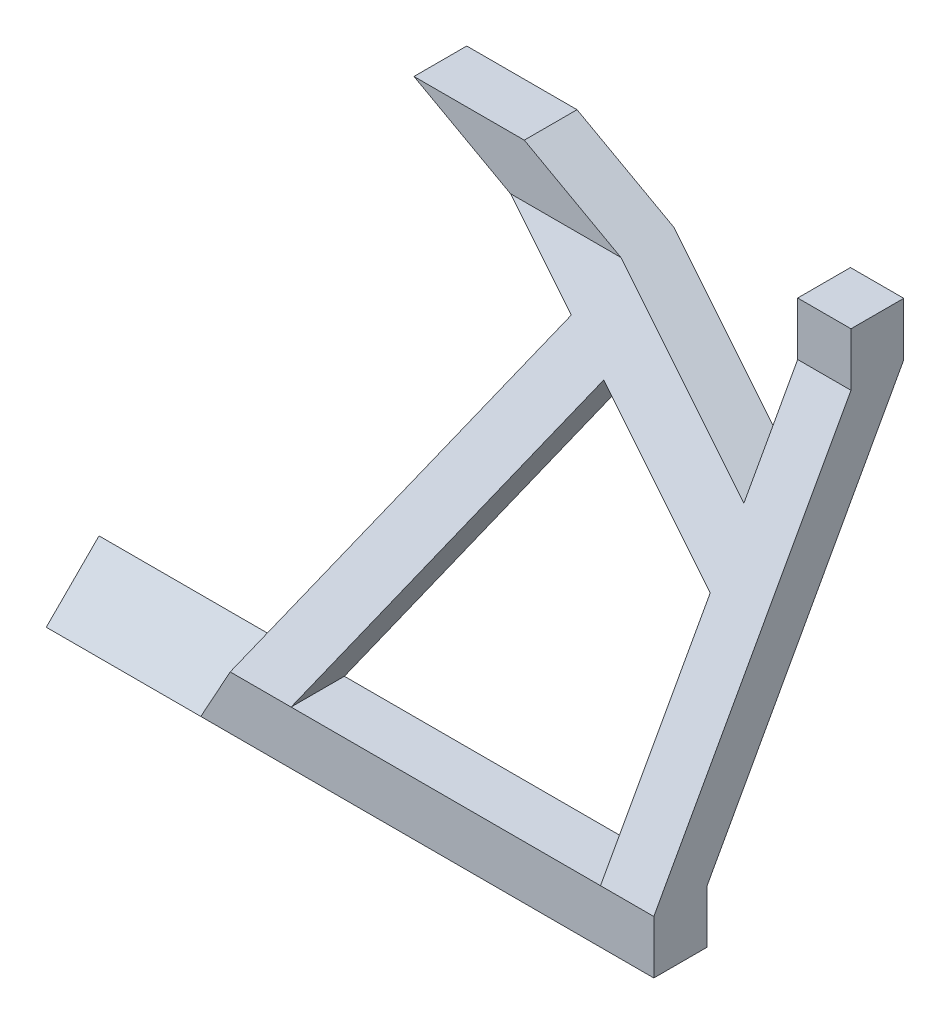
ISO-10303-21;
HEADER;
FILE_DESCRIPTION(('STEP AP214'),'2;1');
FILE_NAME('part.step','',(''),(''),'','','');
FILE_SCHEMA(('AUTOMOTIVE_DESIGN { 1 0 10303 214 1 1 1 1 }'));
ENDSEC;
DATA;
#1=APPLICATION_CONTEXT('core data for automotive mechanical design processes');
#2=APPLICATION_PROTOCOL_DEFINITION('international standard','automotive_design',2000,#1);
#3=PRODUCT_CONTEXT('',#1,'mechanical');
#4=PRODUCT('Part','Part','',(#3));
#5=PRODUCT_RELATED_PRODUCT_CATEGORY('part','',(#4));
#6=PRODUCT_DEFINITION_FORMATION('','',#4);
#7=PRODUCT_DEFINITION_CONTEXT('part definition',#1,'design');
#8=PRODUCT_DEFINITION('design','',#6,#7);
#9=PRODUCT_DEFINITION_SHAPE('','',#8);
#10=(LENGTH_UNIT() NAMED_UNIT(*) SI_UNIT(.MILLI.,.METRE.));
#11=(NAMED_UNIT(*) PLANE_ANGLE_UNIT() SI_UNIT($,.RADIAN.));
#12=(NAMED_UNIT(*) SI_UNIT($,.STERADIAN.) SOLID_ANGLE_UNIT());
#13=UNCERTAINTY_MEASURE_WITH_UNIT(LENGTH_MEASURE(1.E-05),#10,'distance_accuracy_value','');
#14=(GEOMETRIC_REPRESENTATION_CONTEXT(3) GLOBAL_UNCERTAINTY_ASSIGNED_CONTEXT((#13)) GLOBAL_UNIT_ASSIGNED_CONTEXT((#10,
#11,#12)) REPRESENTATION_CONTEXT('',''));
#15=CARTESIAN_POINT('',(0.,0.,0.));
#16=DIRECTION('',(0.,0.,1.));
#17=DIRECTION('',(1.,0.,0.));
#18=AXIS2_PLACEMENT_3D('',#15,#16,#17);
#19=CARTESIAN_POINT('',(0.,29.5620174648456,53.6762918738388));
#20=DIRECTION('',(0.,-0.482420541255381,-0.875939736154757));
#21=DIRECTION('',(0.,0.875939736154757,-0.482420541255381));
#22=AXIS2_PLACEMENT_3D('',#19,#20,#21);
#23=PLANE('',#22);
#24=DIRECTION('',(0.435173799181996,0.788649248632509,-0.434345630963277));
#25=VECTOR('',#24,1.);
#26=CARTESIAN_POINT('',(61.1524327788924,3.67148150275816,67.935407948481));
#27=LINE('',#26,#25);
#28=CARTESIAN_POINT('',(64.6444863659764,10.,64.45));
#29=VERTEX_POINT('',#28);
#30=CARTESIAN_POINT('',(93.9619940574629,63.1310259398199,35.188285713741));
#31=VERTEX_POINT('',#30);
#32=EDGE_CURVE('E428',#29,#31,#27,.T.);
#33=ORIENTED_EDGE('',*,*,#32,.F.);
#34=DIRECTION('',(1.,0.,0.));
#35=VECTOR('',#34,1.);
#36=CARTESIAN_POINT('',(0.,10.,64.45));
#37=LINE('',#36,#35);
#38=CARTESIAN_POINT('',(53.2231062253911,10.,64.45));
#39=VERTEX_POINT('',#38);
#40=EDGE_CURVE('E775',#29,#39,#37,.F.);
#41=ORIENTED_EDGE('',*,*,#40,.T.);
#42=DIRECTION('',(-0.435173799181996,-0.788649248632509,0.434345630963277));
#43=VECTOR('',#42,1.);
#44=CARTESIAN_POINT('',(51.8939906134827,7.59129333924137,65.7765862057014));
#45=LINE('',#44,#43);
#46=CARTESIAN_POINT('',(85.2064847609414,67.9622842602294,32.5274882208588));
#47=VERTEX_POINT('',#46);
#48=EDGE_CURVE('E417',#47,#39,#45,.T.);
#49=ORIENTED_EDGE('',*,*,#48,.F.);
#50=DIRECTION('',(0.846111406818246,-0.466881209960925,0.257133084291912));
#51=VECTOR('',#50,1.);
#52=CARTESIAN_POINT('',(43.9773724193007,90.7123591328342,19.9979693731107));
#53=LINE('',#52,#51);
#54=CARTESIAN_POINT('',(68.8277695420515,77.,27.55));
#55=VERTEX_POINT('',#54);
#56=EDGE_CURVE('E401',#55,#47,#53,.T.);
#57=ORIENTED_EDGE('',*,*,#56,.F.);
#58=DIRECTION('',(-1.,0.,0.));
#59=VECTOR('',#58,1.);
#60=CARTESIAN_POINT('',(50.7051424419148,77.,27.55));
#61=LINE('',#60,#59);
#62=CARTESIAN_POINT('',(89.5263108677249,77.,27.55));
#63=VERTEX_POINT('',#62);
#64=EDGE_CURVE('E757',#63,#55,#61,.T.);
#65=ORIENTED_EDGE('',*,*,#64,.F.);
#66=DIRECTION('',(0.846111406818246,-0.466881209960924,0.257133084291912));
#67=VECTOR('',#66,1.);
#68=CARTESIAN_POINT('',(49.8577346026244,98.8889767172891,15.4947277482393));
#69=LINE('',#68,#67);
#70=CARTESIAN_POINT('',(122.705142441915,58.6920408995561,37.6330401612893));
#71=VERTEX_POINT('',#70);
#72=EDGE_CURVE('E382',#63,#71,#69,.T.);
#73=ORIENTED_EDGE('',*,*,#72,.T.);
#74=DIRECTION('',(0.,0.875939736154757,-0.482420541255381));
#75=VECTOR('',#74,1.);
#76=CARTESIAN_POINT('',(122.705142441915,29.5620174648453,53.6762918738389));
#77=LINE('',#76,#75);
#78=CARTESIAN_POINT('',(122.705142441915,77.,27.55));
#79=VERTEX_POINT('',#78);
#80=EDGE_CURVE('E362',#71,#79,#77,.T.);
#81=ORIENTED_EDGE('',*,*,#80,.T.);
#82=CARTESIAN_POINT('',(132.705142441915,77.,27.55));
#83=VERTEX_POINT('',#82);
#84=EDGE_CURVE('E451',#83,#79,#61,.T.);
#85=ORIENTED_EDGE('',*,*,#84,.F.);
#86=DIRECTION('',(0.,-0.875939736154757,0.482420541255381));
#87=VECTOR('',#86,1.);
#88=CARTESIAN_POINT('',(132.705142441915,77.,27.55));
#89=LINE('',#88,#87);
#90=CARTESIAN_POINT('',(132.705142441915,10.,64.45));
#91=VERTEX_POINT('',#90);
#92=EDGE_CURVE('E457',#83,#91,#89,.T.);
#93=ORIENTED_EDGE('',*,*,#92,.T.);
#94=CARTESIAN_POINT('',(122.705142441915,10.,64.45));
#95=VERTEX_POINT('',#94);
#96=EDGE_CURVE('E773',#91,#95,#37,.F.);
#97=ORIENTED_EDGE('',*,*,#96,.T.);
#98=DIRECTION('',(0.,-0.875939736154757,0.482420541255381));
#99=VECTOR('',#98,1.);
#100=CARTESIAN_POINT('',(122.705142441915,29.562017464846,53.6762918738386));
#101=LINE('',#100,#99);
#102=CARTESIAN_POINT('',(122.705142441915,47.2706607589708,43.9233226566265));
#103=VERTEX_POINT('',#102);
#104=EDGE_CURVE('E424',#103,#95,#101,.T.);
#105=ORIENTED_EDGE('',*,*,#104,.F.);
#106=DIRECTION('',(0.846111406818246,-0.466881209960924,0.257133084291912));
#107=VECTOR('',#106,1.);
#108=CARTESIAN_POINT('',(43.9773724193006,90.7123591328342,19.9979693731107));
#109=LINE('',#108,#107);
#110=EDGE_CURVE('E422',#31,#103,#109,.T.);
#111=ORIENTED_EDGE('',*,*,#110,.F.);
#112=EDGE_LOOP('',(#33,#41,#49,#57,#65,#73,#81,#85,#93,#97,#105,#111));
#113=FACE_BOUND('',#112,.T.);
#114=ADVANCED_FACE('F176',(#113),#23,.T.);
#115=CARTESIAN_POINT('',(0.,33.842872994196,61.2830402867873));
#116=DIRECTION('',(0.,0.483422700834169,0.875387052861874));
#117=DIRECTION('',(0.,-0.875387052861874,0.483422700834169));
#118=AXIS2_PLACEMENT_3D('',#115,#116,#117);
#119=PLANE('',#118);
#120=DIRECTION('',(-0.434951180292689,-0.788245804720872,0.435299922010034));
#121=VECTOR('',#120,1.);
#122=CARTESIAN_POINT('',(63.082326799024,7.16895646972114,76.0134120988107));
#123=LINE('',#122,#121);
#124=CARTESIAN_POINT('',(93.9619940574629,63.1310259398199,45.1089856750248));
#125=VERTEX_POINT('',#124);
#126=CARTESIAN_POINT('',(64.6444863659764,10.,74.45));
#127=VERTEX_POINT('',#126);
#128=EDGE_CURVE('E790',#125,#127,#123,.T.);
#129=ORIENTED_EDGE('',*,*,#128,.F.);
#130=DIRECTION('',(-0.845959635986386,0.466797463365565,-0.257783673798894));
#131=VECTOR('',#130,1.);
#132=CARTESIAN_POINT('',(41.8111105903259,91.9076945646152,29.2173925538692));
#133=LINE('',#132,#131);
#134=CARTESIAN_POINT('',(122.705142441915,47.2706607589708,53.8676948047474));
#135=VERTEX_POINT('',#134);
#136=EDGE_CURVE('E797',#135,#125,#133,.T.);
#137=ORIENTED_EDGE('',*,*,#136,.F.);
#138=DIRECTION('',(0.,0.875387052861874,-0.483422700834169));
#139=VECTOR('',#138,1.);
#140=CARTESIAN_POINT('',(122.705142441915,33.8428729941964,61.283040286787));
#141=LINE('',#140,#139);
#142=CARTESIAN_POINT('',(122.705142441915,9.99999999999999,74.45));
#143=VERTEX_POINT('',#142);
#144=EDGE_CURVE('E791',#143,#135,#141,.T.);
#145=ORIENTED_EDGE('',*,*,#144,.F.);
#146=DIRECTION('',(1.,0.,0.));
#147=VECTOR('',#146,1.);
#148=CARTESIAN_POINT('',(0.,9.99999999999998,74.45));
#149=LINE('',#148,#147);
#150=CARTESIAN_POINT('',(132.705142441915,10.,74.45));
#151=VERTEX_POINT('',#150);
#152=EDGE_CURVE('E768',#143,#151,#149,.T.);
#153=ORIENTED_EDGE('',*,*,#152,.T.);
#154=DIRECTION('',(0.,-0.875387052861874,0.483422700834169));
#155=VECTOR('',#154,1.);
#156=CARTESIAN_POINT('',(132.705142441915,77.,37.45));
#157=LINE('',#156,#155);
#158=CARTESIAN_POINT('',(132.705142441915,77.,37.45));
#159=VERTEX_POINT('',#158);
#160=EDGE_CURVE('E784',#159,#151,#157,.T.);
#161=ORIENTED_EDGE('',*,*,#160,.F.);
#162=DIRECTION('',(1.,0.,0.));
#163=VECTOR('',#162,1.);
#164=CARTESIAN_POINT('',(50.7051424419148,77.,37.45));
#165=LINE('',#164,#163);
#166=CARTESIAN_POINT('',(122.705142441915,77.,37.45));
#167=VERTEX_POINT('',#166);
#168=EDGE_CURVE('E508',#167,#159,#165,.T.);
#169=ORIENTED_EDGE('',*,*,#168,.F.);
#170=DIRECTION('',(0.,-0.875387052861874,0.483422700834169));
#171=VECTOR('',#170,1.);
#172=CARTESIAN_POINT('',(122.705142441915,33.8428729941957,61.2830402867874));
#173=LINE('',#172,#171);
#174=CARTESIAN_POINT('',(122.705142441915,58.6920408995561,47.5603654733795));
#175=VERTEX_POINT('',#174);
#176=EDGE_CURVE('E372',#167,#175,#173,.T.);
#177=ORIENTED_EDGE('',*,*,#176,.T.);
#178=DIRECTION('',(-0.845959635986386,0.466797463365565,-0.257783673798894));
#179=VECTOR('',#178,1.);
#180=CARTESIAN_POINT('',(47.6967883045674,100.081379058361,24.7035667886665));
#181=LINE('',#180,#179);
#182=CARTESIAN_POINT('',(89.5263108677249,77.,37.45));
#183=VERTEX_POINT('',#182);
#184=EDGE_CURVE('E392',#175,#183,#181,.T.);
#185=ORIENTED_EDGE('',*,*,#184,.T.);
#186=CARTESIAN_POINT('',(68.8277695420515,77.,37.45));
#187=VERTEX_POINT('',#186);
#188=EDGE_CURVE('E503',#187,#183,#165,.T.);
#189=ORIENTED_EDGE('',*,*,#188,.F.);
#190=DIRECTION('',(-0.845959635986386,0.466797463365566,-0.257783673798894));
#191=VECTOR('',#190,1.);
#192=CARTESIAN_POINT('',(41.811110590326,91.9076945646152,29.2173925538692));
#193=LINE('',#192,#191);
#194=CARTESIAN_POINT('',(85.2064847609414,67.9622842602294,42.4409773488285));
#195=VERTEX_POINT('',#194);
#196=EDGE_CURVE('E409',#195,#187,#193,.T.);
#197=ORIENTED_EDGE('',*,*,#196,.F.);
#198=DIRECTION('',(0.434951180292689,0.788245804720872,-0.435299922010034));
#199=VECTOR('',#198,1.);
#200=CARTESIAN_POINT('',(53.8216722408234,11.0847588692494,73.8509540572802));
#201=LINE('',#200,#199);
#202=CARTESIAN_POINT('',(53.2231062253911,9.99999999999998,74.45));
#203=VERTEX_POINT('',#202);
#204=EDGE_CURVE('E745',#203,#195,#201,.T.);
#205=ORIENTED_EDGE('',*,*,#204,.F.);
#206=EDGE_CURVE('E772',#203,#127,#149,.T.);
#207=ORIENTED_EDGE('',*,*,#206,.T.);
#208=EDGE_LOOP('',(#129,#137,#145,#153,#161,#169,#177,#185,#189,#197,#205,#207));
#209=FACE_BOUND('',#208,.T.);
#210=ADVANCED_FACE('F469',(#209),#119,.T.);
#211=CARTESIAN_POINT('',(50.7051424419148,77.,37.45));
#212=DIRECTION('',(0.,0.,1.));
#213=DIRECTION('',(1.,0.,0.));
#214=AXIS2_PLACEMENT_3D('',#211,#212,#213);
#215=PLANE('',#214);
#216=DIRECTION('',(-0.875550929652146,0.483125832040953,0.));
#217=VECTOR('',#216,1.);
#218=CARTESIAN_POINT('',(54.9351551557391,84.6658943041474,37.45));
#219=LINE('',#218,#217);
#220=CARTESIAN_POINT('',(50.7051424419148,87.,37.45));
#221=VERTEX_POINT('',#220);
#222=EDGE_CURVE('E405',#187,#221,#219,.T.);
#223=ORIENTED_EDGE('',*,*,#222,.F.);
#224=ORIENTED_EDGE('',*,*,#188,.T.);
#225=DIRECTION('',(-0.875550929652146,0.483125832040952,0.));
#226=VECTOR('',#225,1.);
#227=CARTESIAN_POINT('',(59.7664134761486,93.4214036006688,37.45));
#228=LINE('',#227,#226);
#229=CARTESIAN_POINT('',(71.4036837675881,87.,37.45));
#230=VERTEX_POINT('',#229);
#231=EDGE_CURVE('E387',#183,#230,#228,.T.);
#232=ORIENTED_EDGE('',*,*,#231,.T.);
#233=DIRECTION('',(1.,0.,0.));
#234=VECTOR('',#233,1.);
#235=CARTESIAN_POINT('',(50.7051424419148,87.,37.45));
#236=LINE('',#235,#234);
#237=EDGE_CURVE('E442',#221,#230,#236,.T.);
#238=ORIENTED_EDGE('',*,*,#237,.F.);
#239=EDGE_LOOP('',(#223,#224,#232,#238));
#240=FACE_BOUND('',#239,.T.);
#241=ADVANCED_FACE('F476',(#240),#215,.T.);
#242=CARTESIAN_POINT('',(122.705142441915,87.,37.45));
#243=VERTEX_POINT('',#242);
#244=CARTESIAN_POINT('',(132.705142441915,87.,37.45));
#245=VERTEX_POINT('',#244);
#246=EDGE_CURVE('E441',#243,#245,#236,.T.);
#247=ORIENTED_EDGE('',*,*,#246,.F.);
#248=DIRECTION('',(0.,-1.,0.));
#249=VECTOR('',#248,1.);
#250=CARTESIAN_POINT('',(122.705142441915,76.9999999999998,37.45));
#251=LINE('',#250,#249);
#252=EDGE_CURVE('E367',#243,#167,#251,.T.);
#253=ORIENTED_EDGE('',*,*,#252,.T.);
#254=ORIENTED_EDGE('',*,*,#168,.T.);
#255=DIRECTION('',(0.,1.,0.));
#256=VECTOR('',#255,1.);
#257=CARTESIAN_POINT('',(132.705142441915,77.,37.45));
#258=LINE('',#257,#256);
#259=EDGE_CURVE('E737',#159,#245,#258,.T.);
#260=ORIENTED_EDGE('',*,*,#259,.T.);
#261=EDGE_LOOP('',(#247,#253,#254,#260));
#262=FACE_BOUND('',#261,.T.);
#263=ADVANCED_FACE('F526',(#262),#215,.T.);
#264=CARTESIAN_POINT('',(50.7051424419148,77.,27.55));
#265=DIRECTION('',(0.,0.,-1.));
#266=DIRECTION('',(-1.,0.,0.));
#267=AXIS2_PLACEMENT_3D('',#264,#265,#266);
#268=PLANE('',#267);
#269=DIRECTION('',(0.875550929652146,-0.483125832040953,0.));
#270=VECTOR('',#269,1.);
#271=CARTESIAN_POINT('',(54.9351551557391,84.6658943041474,27.55));
#272=LINE('',#271,#270);
#273=CARTESIAN_POINT('',(50.7051424419148,87.,27.55));
#274=VERTEX_POINT('',#273);
#275=EDGE_CURVE('E397',#274,#55,#272,.T.);
#276=ORIENTED_EDGE('',*,*,#275,.F.);
#277=DIRECTION('',(-1.,0.,0.));
#278=VECTOR('',#277,1.);
#279=CARTESIAN_POINT('',(50.7051424419148,87.,27.55));
#280=LINE('',#279,#278);
#281=CARTESIAN_POINT('',(71.4036837675881,87.,27.55));
#282=VERTEX_POINT('',#281);
#283=EDGE_CURVE('E434',#282,#274,#280,.T.);
#284=ORIENTED_EDGE('',*,*,#283,.F.);
#285=DIRECTION('',(0.875550929652146,-0.483125832040952,0.));
#286=VECTOR('',#285,1.);
#287=CARTESIAN_POINT('',(59.7664134761486,93.4214036006688,27.55));
#288=LINE('',#287,#286);
#289=EDGE_CURVE('E377',#282,#63,#288,.T.);
#290=ORIENTED_EDGE('',*,*,#289,.T.);
#291=ORIENTED_EDGE('',*,*,#64,.T.);
#292=EDGE_LOOP('',(#276,#284,#290,#291));
#293=FACE_BOUND('',#292,.T.);
#294=ADVANCED_FACE('F470',(#293),#268,.T.);
#295=ORIENTED_EDGE('',*,*,#84,.T.);
#296=DIRECTION('',(0.,1.,0.));
#297=VECTOR('',#296,1.);
#298=CARTESIAN_POINT('',(122.705142441915,76.9999999999998,27.55));
#299=LINE('',#298,#297);
#300=CARTESIAN_POINT('',(122.705142441915,87.,27.55));
#301=VERTEX_POINT('',#300);
#302=EDGE_CURVE('E359',#79,#301,#299,.T.);
#303=ORIENTED_EDGE('',*,*,#302,.T.);
#304=CARTESIAN_POINT('',(132.705142441915,87.,27.55));
#305=VERTEX_POINT('',#304);
#306=EDGE_CURVE('E435',#305,#301,#280,.T.);
#307=ORIENTED_EDGE('',*,*,#306,.F.);
#308=DIRECTION('',(0.,1.,0.));
#309=VECTOR('',#308,1.);
#310=CARTESIAN_POINT('',(132.705142441915,77.,27.55));
#311=LINE('',#310,#309);
#312=EDGE_CURVE('E445',#83,#305,#311,.T.);
#313=ORIENTED_EDGE('',*,*,#312,.F.);
#314=EDGE_LOOP('',(#295,#303,#307,#313));
#315=FACE_BOUND('',#314,.T.);
#316=ADVANCED_FACE('F532',(#315),#268,.T.);
#317=CARTESIAN_POINT('',(0.,87.,0.));
#318=DIRECTION('',(0.,-1.,0.));
#319=DIRECTION('',(0.,0.,-1.));
#320=AXIS2_PLACEMENT_3D('',#317,#318,#319);
#321=PLANE('',#320);
#322=DIRECTION('',(0.,0.,1.));
#323=VECTOR('',#322,1.);
#324=CARTESIAN_POINT('',(71.4036837675881,87.,0.));
#325=LINE('',#324,#323);
#326=EDGE_CURVE('E742',#282,#230,#325,.T.);
#327=ORIENTED_EDGE('',*,*,#326,.F.);
#328=ORIENTED_EDGE('',*,*,#283,.T.);
#329=DIRECTION('',(0.,0.,1.));
#330=VECTOR('',#329,1.);
#331=CARTESIAN_POINT('',(50.7051424419148,87.,37.45));
#332=LINE('',#331,#330);
#333=EDGE_CURVE('E438',#274,#221,#332,.T.);
#334=ORIENTED_EDGE('',*,*,#333,.T.);
#335=ORIENTED_EDGE('',*,*,#237,.T.);
#336=EDGE_LOOP('',(#327,#328,#334,#335));
#337=FACE_BOUND('',#336,.T.);
#338=ADVANCED_FACE('F528',(#337),#321,.F.);
#339=DIRECTION('',(0.,0.,-1.));
#340=VECTOR('',#339,1.);
#341=CARTESIAN_POINT('',(122.705142441915,87.,0.));
#342=LINE('',#341,#340);
#343=EDGE_CURVE('E740',#243,#301,#342,.T.);
#344=ORIENTED_EDGE('',*,*,#343,.F.);
#345=ORIENTED_EDGE('',*,*,#246,.T.);
#346=DIRECTION('',(0.,0.,-1.));
#347=VECTOR('',#346,1.);
#348=CARTESIAN_POINT('',(132.705142441915,87.,37.45));
#349=LINE('',#348,#347);
#350=EDGE_CURVE('E431',#245,#305,#349,.T.);
#351=ORIENTED_EDGE('',*,*,#350,.T.);
#352=ORIENTED_EDGE('',*,*,#306,.T.);
#353=EDGE_LOOP('',(#344,#345,#351,#352));
#354=FACE_BOUND('',#353,.T.);
#355=ADVANCED_FACE('F531',(#354),#321,.F.);
#356=CARTESIAN_POINT('',(47.7051424419148,10.,74.45));
#357=DIRECTION('',(0.,0.,-1.));
#358=DIRECTION('',(-1.,0.,0.));
#359=AXIS2_PLACEMENT_3D('',#356,#357,#358);
#360=PLANE('',#359);
#361=ORIENTED_EDGE('',*,*,#206,.F.);
#362=DIRECTION('',(-0.483125832040953,-0.875550929652146,0.));
#363=VECTOR('',#362,1.);
#364=CARTESIAN_POINT('',(51.9351551557391,7.66589430414738,74.45));
#365=LINE('',#364,#363);
#366=CARTESIAN_POINT('',(47.7051424419148,0.,74.45));
#367=VERTEX_POINT('',#366);
#368=EDGE_CURVE('E413',#203,#367,#365,.T.);
#369=ORIENTED_EDGE('',*,*,#368,.T.);
#370=DIRECTION('',(1.,0.,0.));
#371=VECTOR('',#370,1.);
#372=CARTESIAN_POINT('',(47.7051424419148,0.,74.45));
#373=LINE('',#372,#371);
#374=CARTESIAN_POINT('',(132.705142441915,0.,74.45));
#375=VERTEX_POINT('',#374);
#376=EDGE_CURVE('E321',#367,#375,#373,.T.);
#377=ORIENTED_EDGE('',*,*,#376,.T.);
#378=DIRECTION('',(0.,-1.,0.));
#379=VECTOR('',#378,1.);
#380=CARTESIAN_POINT('',(132.705142441915,10.,74.45));
#381=LINE('',#380,#379);
#382=EDGE_CURVE('E743',#151,#375,#381,.T.);
#383=ORIENTED_EDGE('',*,*,#382,.F.);
#384=ORIENTED_EDGE('',*,*,#152,.F.);
#385=EDGE_CURVE('E770',#127,#143,#149,.T.);
#386=ORIENTED_EDGE('',*,*,#385,.F.);
#387=EDGE_LOOP('',(#361,#369,#377,#383,#384,#386));
#388=FACE_BOUND('',#387,.T.);
#389=ADVANCED_FACE('F178',(#388),#360,.F.);
#390=CARTESIAN_POINT('',(132.705142441915,10.,74.45));
#391=DIRECTION('',(-1.,0.,0.));
#392=DIRECTION('',(0.,0.,1.));
#393=AXIS2_PLACEMENT_3D('',#390,#391,#392);
#394=PLANE('',#393);
#395=ORIENTED_EDGE('',*,*,#382,.T.);
#396=DIRECTION('',(0.,0.,-1.));
#397=VECTOR('',#396,1.);
#398=CARTESIAN_POINT('',(132.705142441915,0.,74.45));
#399=LINE('',#398,#397);
#400=CARTESIAN_POINT('',(132.705142441915,0.,64.45));
#401=VERTEX_POINT('',#400);
#402=EDGE_CURVE('E781',#375,#401,#399,.T.);
#403=ORIENTED_EDGE('',*,*,#402,.T.);
#404=DIRECTION('',(0.,-1.,0.));
#405=VECTOR('',#404,1.);
#406=CARTESIAN_POINT('',(132.705142441915,10.,64.45));
#407=LINE('',#406,#405);
#408=EDGE_CURVE('E748',#91,#401,#407,.T.);
#409=ORIENTED_EDGE('',*,*,#408,.F.);
#410=ORIENTED_EDGE('',*,*,#92,.F.);
#411=ORIENTED_EDGE('',*,*,#312,.T.);
#412=ORIENTED_EDGE('',*,*,#350,.F.);
#413=ORIENTED_EDGE('',*,*,#259,.F.);
#414=ORIENTED_EDGE('',*,*,#160,.T.);
#415=EDGE_LOOP('',(#395,#403,#409,#410,#411,#412,#413,#414));
#416=FACE_BOUND('',#415,.T.);
#417=ADVANCED_FACE('F627',(#416),#394,.F.);
#418=CARTESIAN_POINT('',(47.7051424419148,10.,64.45));
#419=DIRECTION('',(0.,0.,1.));
#420=DIRECTION('',(1.,0.,0.));
#421=AXIS2_PLACEMENT_3D('',#418,#419,#420);
#422=PLANE('',#421);
#423=DIRECTION('',(-1.,0.,0.));
#424=VECTOR('',#423,1.);
#425=CARTESIAN_POINT('',(47.7051424419148,0.,64.45));
#426=LINE('',#425,#424);
#427=CARTESIAN_POINT('',(47.7051424419148,0.,64.45));
#428=VERTEX_POINT('',#427);
#429=EDGE_CURVE('E771',#401,#428,#426,.T.);
#430=ORIENTED_EDGE('',*,*,#429,.T.);
#431=DIRECTION('',(0.483125832040953,0.875550929652146,0.));
#432=VECTOR('',#431,1.);
#433=CARTESIAN_POINT('',(51.9351551557391,7.66589430414738,64.45));
#434=LINE('',#433,#432);
#435=EDGE_CURVE('E419',#428,#39,#434,.T.);
#436=ORIENTED_EDGE('',*,*,#435,.T.);
#437=ORIENTED_EDGE('',*,*,#40,.F.);
#438=DIRECTION('',(-1.,0.,0.));
#439=VECTOR('',#438,1.);
#440=CARTESIAN_POINT('',(0.,10.,64.45));
#441=LINE('',#440,#439);
#442=EDGE_CURVE('E426',#95,#29,#441,.T.);
#443=ORIENTED_EDGE('',*,*,#442,.F.);
#444=ORIENTED_EDGE('',*,*,#96,.F.);
#445=ORIENTED_EDGE('',*,*,#408,.T.);
#446=EDGE_LOOP('',(#430,#436,#437,#443,#444,#445));
#447=FACE_BOUND('',#446,.T.);
#448=ADVANCED_FACE('F622',(#447),#422,.F.);
#449=CARTESIAN_POINT('',(0.,0.,0.));
#450=DIRECTION('',(0.,-1.,0.));
#451=DIRECTION('',(0.,0.,-1.));
#452=AXIS2_PLACEMENT_3D('',#449,#450,#451);
#453=PLANE('',#452);
#454=ORIENTED_EDGE('',*,*,#429,.F.);
#455=ORIENTED_EDGE('',*,*,#402,.F.);
#456=ORIENTED_EDGE('',*,*,#376,.F.);
#457=DIRECTION('',(1.,0.,0.));
#458=VECTOR('',#457,1.);
#459=CARTESIAN_POINT('',(18.7051424419149,0.,74.45));
#460=LINE('',#459,#458);
#461=CARTESIAN_POINT('',(18.7051424419149,0.,74.45));
#462=VERTEX_POINT('',#461);
#463=EDGE_CURVE('E313',#462,#367,#460,.T.);
#464=ORIENTED_EDGE('',*,*,#463,.F.);
#465=DIRECTION('',(0.,0.,-1.));
#466=VECTOR('',#465,1.);
#467=CARTESIAN_POINT('',(18.7051424419149,0.,64.55));
#468=LINE('',#467,#466);
#469=CARTESIAN_POINT('',(18.7051424419149,0.,64.55));
#470=VERTEX_POINT('',#469);
#471=EDGE_CURVE('E318',#462,#470,#468,.T.);
#472=ORIENTED_EDGE('',*,*,#471,.T.);
#473=DIRECTION('',(1.,0.,0.));
#474=VECTOR('',#473,1.);
#475=CARTESIAN_POINT('',(18.7051424419149,0.,64.55));
#476=LINE('',#475,#474);
#477=CARTESIAN_POINT('',(47.7051424419148,0.,64.55));
#478=VERTEX_POINT('',#477);
#479=EDGE_CURVE('E325',#470,#478,#476,.T.);
#480=ORIENTED_EDGE('',*,*,#479,.T.);
#481=DIRECTION('',(0.,0.,1.));
#482=VECTOR('',#481,1.);
#483=CARTESIAN_POINT('',(47.7051424419148,0.,74.45));
#484=LINE('',#483,#482);
#485=EDGE_CURVE('E194',#428,#478,#484,.T.);
#486=ORIENTED_EDGE('',*,*,#485,.F.);
#487=EDGE_LOOP('',(#454,#455,#456,#464,#472,#480,#486));
#488=FACE_BOUND('',#487,.T.);
#489=ADVANCED_FACE('F316',(#488),#453,.T.);
#490=CARTESIAN_POINT('',(53.4674851089494,96.8971294611604,27.5499));
#491=DIRECTION('',(0.483125832040952,0.875550929652146,0.));
#492=DIRECTION('',(-0.875550929652146,0.483125832040952,0.));
#493=AXIS2_PLACEMENT_3D('',#490,#491,#492);
#494=PLANE('',#493);
#495=DIRECTION('',(0.,0.,-1.));
#496=VECTOR('',#495,1.);
#497=CARTESIAN_POINT('',(122.705142441915,58.6920408995561,27.5499));
#498=LINE('',#497,#496);
#499=EDGE_CURVE('E356',#175,#71,#498,.T.);
#500=ORIENTED_EDGE('',*,*,#499,.T.);
#501=ORIENTED_EDGE('',*,*,#72,.F.);
#502=ORIENTED_EDGE('',*,*,#289,.F.);
#503=ORIENTED_EDGE('',*,*,#326,.T.);
#504=ORIENTED_EDGE('',*,*,#231,.F.);
#505=ORIENTED_EDGE('',*,*,#184,.F.);
#506=EDGE_LOOP('',(#500,#501,#502,#503,#504,#505));
#507=FACE_BOUND('',#506,.T.);
#508=ADVANCED_FACE('F534',(#507),#494,.T.);
#509=CARTESIAN_POINT('',(122.705142441915,-3.00776881105116E-13,27.5499));
#510=DIRECTION('',(-1.,0.,0.));
#511=DIRECTION('',(0.,-1.,0.));
#512=AXIS2_PLACEMENT_3D('',#509,#510,#511);
#513=PLANE('',#512);
#514=ORIENTED_EDGE('',*,*,#252,.F.);
#515=ORIENTED_EDGE('',*,*,#343,.T.);
#516=ORIENTED_EDGE('',*,*,#302,.F.);
#517=ORIENTED_EDGE('',*,*,#80,.F.);
#518=ORIENTED_EDGE('',*,*,#499,.F.);
#519=ORIENTED_EDGE('',*,*,#176,.F.);
#520=EDGE_LOOP('',(#514,#515,#516,#517,#518,#519));
#521=FACE_BOUND('',#520,.T.);
#522=ADVANCED_FACE('F537',(#521),#513,.T.);
#523=CARTESIAN_POINT('',(85.2064847609414,67.9622842602294,27.5499));
#524=DIRECTION('',(0.875550929652146,-0.483125832040953,0.));
#525=DIRECTION('',(0.483125832040953,0.875550929652146,0.));
#526=AXIS2_PLACEMENT_3D('',#523,#524,#525);
#527=PLANE('',#526);
#528=DIRECTION('',(0.483125832040953,0.875550929652146,0.));
#529=VECTOR('',#528,1.);
#530=CARTESIAN_POINT('',(85.2064847609414,67.9622842602294,64.55));
#531=LINE('',#530,#529);
#532=CARTESIAN_POINT('',(53.1679265875563,9.9,64.55));
#533=VERTEX_POINT('',#532);
#534=EDGE_CURVE('E184',#478,#533,#531,.T.);
#535=ORIENTED_EDGE('',*,*,#534,.T.);
#536=DIRECTION('',(-0.363489981504622,-0.658739338944384,0.658739338944385));
#537=VECTOR('',#536,1.);
#538=CARTESIAN_POINT('',(80.1632468887006,58.8226123266387,15.6273876733613));
#539=LINE('',#538,#537);
#540=EDGE_CURVE('E12',#533,#367,#539,.T.);
#541=ORIENTED_EDGE('',*,*,#540,.T.);
#542=ORIENTED_EDGE('',*,*,#368,.F.);
#543=ORIENTED_EDGE('',*,*,#204,.T.);
#544=DIRECTION('',(0.,0.,-1.));
#545=VECTOR('',#544,1.);
#546=CARTESIAN_POINT('',(85.2064847609414,67.9622842602294,27.5499));
#547=LINE('',#546,#545);
#548=EDGE_CURVE('E341',#195,#47,#547,.T.);
#549=ORIENTED_EDGE('',*,*,#548,.T.);
#550=ORIENTED_EDGE('',*,*,#48,.T.);
#551=ORIENTED_EDGE('',*,*,#435,.F.);
#552=ORIENTED_EDGE('',*,*,#485,.T.);
#553=EDGE_LOOP('',(#535,#541,#542,#543,#549,#550,#551,#552));
#554=FACE_BOUND('',#553,.T.);
#555=ADVANCED_FACE('F541',(#554),#527,.F.);
#556=CARTESIAN_POINT('',(50.7051424419148,87.,27.5499));
#557=DIRECTION('',(0.483125832040953,0.875550929652146,0.));
#558=DIRECTION('',(-0.875550929652146,0.483125832040953,0.));
#559=AXIS2_PLACEMENT_3D('',#556,#557,#558);
#560=PLANE('',#559);
#561=ORIENTED_EDGE('',*,*,#196,.T.);
#562=ORIENTED_EDGE('',*,*,#222,.T.);
#563=ORIENTED_EDGE('',*,*,#333,.F.);
#564=ORIENTED_EDGE('',*,*,#275,.T.);
#565=ORIENTED_EDGE('',*,*,#56,.T.);
#566=ORIENTED_EDGE('',*,*,#548,.F.);
#567=EDGE_LOOP('',(#561,#562,#563,#564,#565,#566));
#568=FACE_BOUND('',#567,.T.);
#569=ADVANCED_FACE('F558',(#568),#560,.F.);
#570=CARTESIAN_POINT('',(45.3257672689229,-25.0105942248191,27.5499));
#571=DIRECTION('',(-0.875550929652146,0.483125832040953,0.));
#572=DIRECTION('',(-0.483125832040953,-0.875550929652146,0.));
#573=AXIS2_PLACEMENT_3D('',#570,#571,#572);
#574=PLANE('',#573);
#575=ORIENTED_EDGE('',*,*,#32,.T.);
#576=DIRECTION('',(0.,0.,-1.));
#577=VECTOR('',#576,1.);
#578=CARTESIAN_POINT('',(93.9619940574629,63.1310259398199,27.5499));
#579=LINE('',#578,#577);
#580=EDGE_CURVE('E354',#125,#31,#579,.T.);
#581=ORIENTED_EDGE('',*,*,#580,.F.);
#582=ORIENTED_EDGE('',*,*,#128,.T.);
#583=DIRECTION('',(0.,0.,-1.));
#584=VECTOR('',#583,1.);
#585=CARTESIAN_POINT('',(64.6444863659764,10.,27.5499));
#586=LINE('',#585,#584);
#587=EDGE_CURVE('E345',#127,#29,#586,.T.);
#588=ORIENTED_EDGE('',*,*,#587,.T.);
#589=EDGE_LOOP('',(#575,#581,#582,#588));
#590=FACE_BOUND('',#589,.T.);
#591=ADVANCED_FACE('F554',(#590),#574,.F.);
#592=CARTESIAN_POINT('',(0.,10.,27.5499));
#593=DIRECTION('',(0.,-1.,0.));
#594=DIRECTION('',(1.,0.,0.));
#595=AXIS2_PLACEMENT_3D('',#592,#593,#594);
#596=PLANE('',#595);
#597=ORIENTED_EDGE('',*,*,#442,.T.);
#598=ORIENTED_EDGE('',*,*,#587,.F.);
#599=ORIENTED_EDGE('',*,*,#385,.T.);
#600=DIRECTION('',(0.,0.,-1.));
#601=VECTOR('',#600,1.);
#602=CARTESIAN_POINT('',(122.705142441915,9.99999999999999,27.5499));
#603=LINE('',#602,#601);
#604=EDGE_CURVE('E348',#143,#95,#603,.T.);
#605=ORIENTED_EDGE('',*,*,#604,.T.);
#606=EDGE_LOOP('',(#597,#598,#599,#605));
#607=FACE_BOUND('',#606,.T.);
#608=ADVANCED_FACE('F550',(#607),#596,.F.);
#609=CARTESIAN_POINT('',(122.705142441915,5.93962828556688E-13,27.5499));
#610=DIRECTION('',(1.,0.,0.));
#611=DIRECTION('',(0.,1.,0.));
#612=AXIS2_PLACEMENT_3D('',#609,#610,#611);
#613=PLANE('',#612);
#614=ORIENTED_EDGE('',*,*,#104,.T.);
#615=ORIENTED_EDGE('',*,*,#604,.F.);
#616=ORIENTED_EDGE('',*,*,#144,.T.);
#617=DIRECTION('',(0.,0.,-1.));
#618=VECTOR('',#617,1.);
#619=CARTESIAN_POINT('',(122.705142441915,47.2706607589708,27.5499));
#620=LINE('',#619,#618);
#621=EDGE_CURVE('E351',#135,#103,#620,.T.);
#622=ORIENTED_EDGE('',*,*,#621,.T.);
#623=EDGE_LOOP('',(#614,#615,#616,#622));
#624=FACE_BOUND('',#623,.T.);
#625=ADVANCED_FACE('F546',(#624),#613,.F.);
#626=CARTESIAN_POINT('',(48.63622678854,88.141620164639,27.5499));
#627=DIRECTION('',(0.483125832040953,0.875550929652146,0.));
#628=DIRECTION('',(-0.875550929652146,0.483125832040953,0.));
#629=AXIS2_PLACEMENT_3D('',#626,#627,#628);
#630=PLANE('',#629);
#631=ORIENTED_EDGE('',*,*,#110,.T.);
#632=ORIENTED_EDGE('',*,*,#621,.F.);
#633=ORIENTED_EDGE('',*,*,#136,.T.);
#634=ORIENTED_EDGE('',*,*,#580,.T.);
#635=EDGE_LOOP('',(#631,#632,#633,#634));
#636=FACE_BOUND('',#635,.T.);
#637=ADVANCED_FACE('F543',(#636),#630,.F.);
#638=CARTESIAN_POINT('',(18.7051424419149,0.,74.45));
#639=DIRECTION('',(0.,0.707106781186548,0.707106781186547));
#640=DIRECTION('',(0.,-0.707106781186547,0.707106781186548));
#641=AXIS2_PLACEMENT_3D('',#638,#639,#640);
#642=PLANE('',#641);
#643=ORIENTED_EDGE('',*,*,#540,.F.);
#644=DIRECTION('',(1.,0.,0.));
#645=VECTOR('',#644,1.);
#646=CARTESIAN_POINT('',(18.7051424419149,9.9,64.55));
#647=LINE('',#646,#645);
#648=CARTESIAN_POINT('',(18.7051424419149,9.9,64.55));
#649=VERTEX_POINT('',#648);
#650=EDGE_CURVE('E336',#649,#533,#647,.T.);
#651=ORIENTED_EDGE('',*,*,#650,.F.);
#652=DIRECTION('',(0.,-0.707106781186547,0.707106781186548));
#653=VECTOR('',#652,1.);
#654=CARTESIAN_POINT('',(18.7051424419149,0.,74.45));
#655=LINE('',#654,#653);
#656=EDGE_CURVE('E331',#649,#462,#655,.T.);
#657=ORIENTED_EDGE('',*,*,#656,.T.);
#658=ORIENTED_EDGE('',*,*,#463,.T.);
#659=EDGE_LOOP('',(#643,#651,#657,#658));
#660=FACE_BOUND('',#659,.T.);
#661=ADVANCED_FACE('F334',(#660),#642,.T.);
#662=CARTESIAN_POINT('',(18.7051424419149,9.9,64.55));
#663=DIRECTION('',(0.,0.,-1.));
#664=DIRECTION('',(-1.,0.,0.));
#665=AXIS2_PLACEMENT_3D('',#662,#663,#664);
#666=PLANE('',#665);
#667=ORIENTED_EDGE('',*,*,#534,.F.);
#668=ORIENTED_EDGE('',*,*,#479,.F.);
#669=DIRECTION('',(0.,1.,0.));
#670=VECTOR('',#669,1.);
#671=CARTESIAN_POINT('',(18.7051424419149,9.9,64.55));
#672=LINE('',#671,#670);
#673=EDGE_CURVE('E326',#470,#649,#672,.T.);
#674=ORIENTED_EDGE('',*,*,#673,.T.);
#675=ORIENTED_EDGE('',*,*,#650,.T.);
#676=EDGE_LOOP('',(#667,#668,#674,#675));
#677=FACE_BOUND('',#676,.T.);
#678=ADVANCED_FACE('F567',(#677),#666,.T.);
#679=CARTESIAN_POINT('',(18.7051424419149,0.,0.));
#680=DIRECTION('',(-1.,0.,0.));
#681=DIRECTION('',(0.,0.,1.));
#682=AXIS2_PLACEMENT_3D('',#679,#680,#681);
#683=PLANE('',#682);
#684=ORIENTED_EDGE('',*,*,#656,.F.);
#685=ORIENTED_EDGE('',*,*,#673,.F.);
#686=ORIENTED_EDGE('',*,*,#471,.F.);
#687=EDGE_LOOP('',(#684,#685,#686));
#688=FACE_BOUND('',#687,.T.);
#689=ADVANCED_FACE('F330',(#688),#683,.T.);
#690=CLOSED_SHELL('',(#114,#210,#241,#263,#294,#316,#338,#355,#389,#417,#448,#489,#508,#522,
#555,#569,#591,#608,#625,#637,#661,#678,#689));
#691=MANIFOLD_SOLID_BREP('B2',#690);
#692=ADVANCED_BREP_SHAPE_REPRESENTATION('',(#18,#691),#14);
#693=SHAPE_DEFINITION_REPRESENTATION(#9,#692);
ENDSEC;
END-ISO-10303-21;
